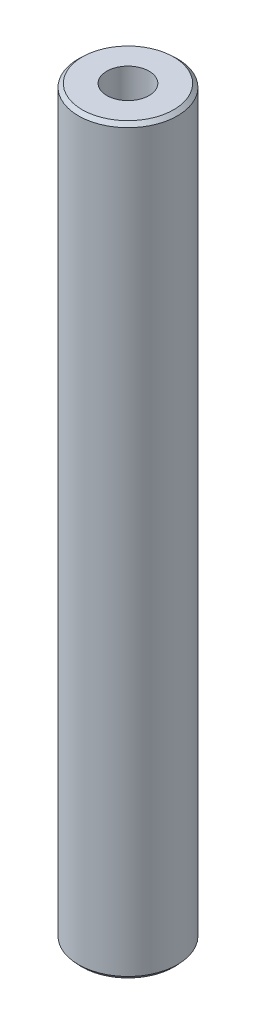
ISO-10303-21;
HEADER;
FILE_DESCRIPTION(('STEP AP214'),'2;1');
FILE_NAME('part.step','',(''),(''),'','','');
FILE_SCHEMA(('AUTOMOTIVE_DESIGN { 1 0 10303 214 1 1 1 1 }'));
ENDSEC;
DATA;
#1=APPLICATION_CONTEXT('core data for automotive mechanical design processes');
#2=APPLICATION_PROTOCOL_DEFINITION('international standard','automotive_design',2000,#1);
#3=PRODUCT_CONTEXT('',#1,'mechanical');
#4=PRODUCT('Part','Part','',(#3));
#5=PRODUCT_RELATED_PRODUCT_CATEGORY('part','',(#4));
#6=PRODUCT_DEFINITION_FORMATION('','',#4);
#7=PRODUCT_DEFINITION_CONTEXT('part definition',#1,'design');
#8=PRODUCT_DEFINITION('design','',#6,#7);
#9=PRODUCT_DEFINITION_SHAPE('','',#8);
#10=(LENGTH_UNIT() NAMED_UNIT(*) SI_UNIT(.MILLI.,.METRE.));
#11=(NAMED_UNIT(*) PLANE_ANGLE_UNIT() SI_UNIT($,.RADIAN.));
#12=(NAMED_UNIT(*) SI_UNIT($,.STERADIAN.) SOLID_ANGLE_UNIT());
#13=UNCERTAINTY_MEASURE_WITH_UNIT(LENGTH_MEASURE(1.E-05),#10,'distance_accuracy_value','');
#14=(GEOMETRIC_REPRESENTATION_CONTEXT(3) GLOBAL_UNCERTAINTY_ASSIGNED_CONTEXT((#13)) GLOBAL_UNIT_ASSIGNED_CONTEXT((#10,
#11,#12)) REPRESENTATION_CONTEXT('',''));
#15=CARTESIAN_POINT('',(0.,0.,0.));
#16=DIRECTION('',(0.,0.,1.));
#17=DIRECTION('',(1.,0.,0.));
#18=AXIS2_PLACEMENT_3D('',#15,#16,#17);
#19=CARTESIAN_POINT('',(0.,600.,0.));
#20=DIRECTION('',(0.,-1.,0.));
#21=DIRECTION('',(0.,0.,-1.));
#22=AXIS2_PLACEMENT_3D('',#19,#20,#21);
#23=CYLINDRICAL_SURFACE('',#22,40.);
#24=CARTESIAN_POINT('',(0.,597.22984167869,0.));
#25=DIRECTION('',(0.,1.,0.));
#26=DIRECTION('',(0.,0.,1.));
#27=AXIS2_PLACEMENT_3D('',#24,#25,#26);
#28=CIRCLE('',#27,40.);
#29=CARTESIAN_POINT('',(0.,597.22984167869,40.));
#30=VERTEX_POINT('',#29);
#31=EDGE_CURVE('E50',#30,#30,#28,.F.);
#32=ORIENTED_EDGE('',*,*,#31,.T.);
#33=EDGE_LOOP('',(#32));
#34=FACE_BOUND('',#33,.T.);
#35=CARTESIAN_POINT('',(0.,3.02482086205613,0.));
#36=DIRECTION('',(0.,1.,0.));
#37=DIRECTION('',(0.,0.,1.));
#38=AXIS2_PLACEMENT_3D('',#35,#36,#37);
#39=CIRCLE('',#38,40.);
#40=CARTESIAN_POINT('',(0.,3.02482086205613,40.));
#41=VERTEX_POINT('',#40);
#42=EDGE_CURVE('E51',#41,#41,#39,.T.);
#43=ORIENTED_EDGE('',*,*,#42,.T.);
#44=EDGE_LOOP('',(#43));
#45=FACE_BOUND('',#44,.T.);
#46=ADVANCED_FACE('F39',(#34,#45),#23,.T.);
#47=CARTESIAN_POINT('',(0.,600.,0.));
#48=DIRECTION('',(0.,1.,0.));
#49=DIRECTION('',(0.,0.,1.));
#50=AXIS2_PLACEMENT_3D('',#47,#48,#49);
#51=PLANE('',#50);
#52=CARTESIAN_POINT('',(0.,600.,0.));
#53=DIRECTION('',(0.,1.,0.));
#54=DIRECTION('',(0.,0.,1.));
#55=AXIS2_PLACEMENT_3D('',#52,#53,#54);
#56=CIRCLE('',#55,36.9751791379438);
#57=CARTESIAN_POINT('',(0.,600.,36.9751791379438));
#58=VERTEX_POINT('',#57);
#59=EDGE_CURVE('E54',#58,#58,#56,.T.);
#60=ORIENTED_EDGE('',*,*,#59,.T.);
#61=EDGE_LOOP('',(#60));
#62=FACE_BOUND('',#61,.T.);
#63=CARTESIAN_POINT('',(0.,600.,0.));
#64=DIRECTION('',(0.,1.,0.));
#65=DIRECTION('',(0.,0.,1.));
#66=AXIS2_PLACEMENT_3D('',#63,#64,#65);
#67=CIRCLE('',#66,17.0955870117119);
#68=CARTESIAN_POINT('',(0.,600.,17.0955870117119));
#69=VERTEX_POINT('',#68);
#70=EDGE_CURVE('E58',#69,#69,#67,.T.);
#71=ORIENTED_EDGE('',*,*,#70,.F.);
#72=EDGE_LOOP('',(#71));
#73=FACE_BOUND('',#72,.T.);
#74=ADVANCED_FACE('F69',(#62,#73),#51,.T.);
#75=CARTESIAN_POINT('',(0.,0.,0.));
#76=DIRECTION('',(0.,1.,0.));
#77=DIRECTION('',(0.,0.,1.));
#78=AXIS2_PLACEMENT_3D('',#75,#76,#77);
#79=PLANE('',#78);
#80=CARTESIAN_POINT('',(0.,0.,0.));
#81=DIRECTION('',(0.,1.,0.));
#82=DIRECTION('',(0.,0.,1.));
#83=AXIS2_PLACEMENT_3D('',#80,#81,#82);
#84=CIRCLE('',#83,37.2298416786901);
#85=CARTESIAN_POINT('',(0.,0.,37.2298416786901));
#86=VERTEX_POINT('',#85);
#87=EDGE_CURVE('E10',#86,#86,#84,.F.);
#88=ORIENTED_EDGE('',*,*,#87,.T.);
#89=EDGE_LOOP('',(#88));
#90=FACE_BOUND('',#89,.T.);
#91=CARTESIAN_POINT('',(0.,0.,0.));
#92=DIRECTION('',(0.,1.,0.));
#93=DIRECTION('',(0.,0.,1.));
#94=AXIS2_PLACEMENT_3D('',#91,#92,#93);
#95=CIRCLE('',#94,17.0955870117119);
#96=CARTESIAN_POINT('',(0.,0.,17.0955870117119));
#97=VERTEX_POINT('',#96);
#98=EDGE_CURVE('E63',#97,#97,#95,.T.);
#99=ORIENTED_EDGE('',*,*,#98,.T.);
#100=EDGE_LOOP('',(#99));
#101=FACE_BOUND('',#100,.T.);
#102=ADVANCED_FACE('F75',(#90,#101),#79,.F.);
#103=CARTESIAN_POINT('',(0.,600.,0.));
#104=DIRECTION('',(0.,-1.,0.));
#105=DIRECTION('',(0.,0.,-1.));
#106=AXIS2_PLACEMENT_3D('',#103,#104,#105);
#107=CYLINDRICAL_SURFACE('',#106,17.0955870117119);
#108=ORIENTED_EDGE('',*,*,#70,.T.);
#109=EDGE_LOOP('',(#108));
#110=FACE_BOUND('',#109,.T.);
#111=ORIENTED_EDGE('',*,*,#98,.F.);
#112=EDGE_LOOP('',(#111));
#113=FACE_BOUND('',#112,.T.);
#114=ADVANCED_FACE('F70',(#110,#113),#107,.F.);
#115=CARTESIAN_POINT('',(0.,600.,0.));
#116=DIRECTION('',(0.,-1.,0.));
#117=DIRECTION('',(0.,0.,-1.));
#118=AXIS2_PLACEMENT_3D('',#115,#116,#117);
#119=CONICAL_SURFACE('',#118,36.9751791379438,0.829315283364699);
#120=ORIENTED_EDGE('',*,*,#31,.F.);
#121=EDGE_LOOP('',(#120));
#122=FACE_BOUND('',#121,.T.);
#123=ORIENTED_EDGE('',*,*,#59,.F.);
#124=EDGE_LOOP('',(#123));
#125=FACE_BOUND('',#124,.T.);
#126=ADVANCED_FACE('F81',(#122,#125),#119,.T.);
#127=CARTESIAN_POINT('',(0.,3.02482086205613,0.));
#128=DIRECTION('',(0.,1.,0.));
#129=DIRECTION('',(0.,0.,1.));
#130=AXIS2_PLACEMENT_3D('',#127,#128,#129);
#131=CONICAL_SURFACE('',#130,40.,0.741481043430214);
#132=ORIENTED_EDGE('',*,*,#87,.F.);
#133=EDGE_LOOP('',(#132));
#134=FACE_BOUND('',#133,.T.);
#135=ORIENTED_EDGE('',*,*,#42,.F.);
#136=EDGE_LOOP('',(#135));
#137=FACE_BOUND('',#136,.T.);
#138=ADVANCED_FACE('F45',(#134,#137),#131,.T.);
#139=CLOSED_SHELL('',(#46,#74,#102,#114,#126,#138));
#140=MANIFOLD_SOLID_BREP('B2',#139);
#141=ADVANCED_BREP_SHAPE_REPRESENTATION('',(#18,#140),#14);
#142=SHAPE_DEFINITION_REPRESENTATION(#9,#141);
ENDSEC;
END-ISO-10303-21;
